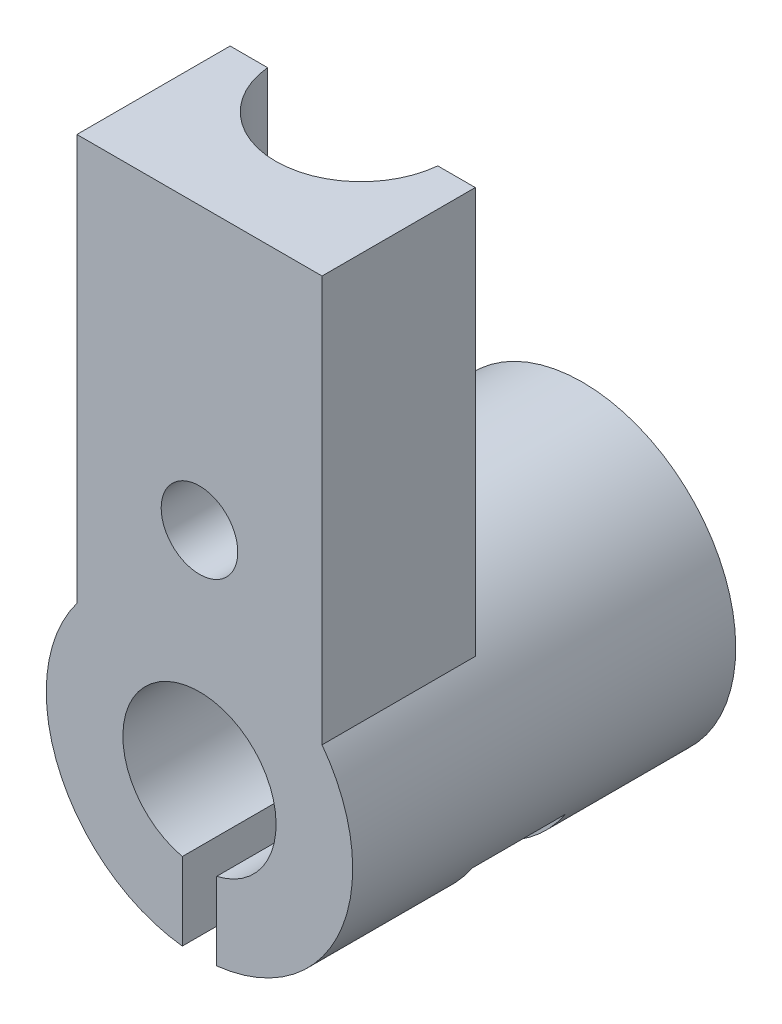
ISO-10303-21;
HEADER;
FILE_DESCRIPTION(('STEP AP214'),'2;1');
FILE_NAME('part.step','',(''),(''),'','','');
FILE_SCHEMA(('AUTOMOTIVE_DESIGN { 1 0 10303 214 1 1 1 1 }'));
ENDSEC;
DATA;
#1=APPLICATION_CONTEXT('core data for automotive mechanical design processes');
#2=APPLICATION_PROTOCOL_DEFINITION('international standard','automotive_design',2000,#1);
#3=PRODUCT_CONTEXT('',#1,'mechanical');
#4=PRODUCT('Part','Part','',(#3));
#5=PRODUCT_RELATED_PRODUCT_CATEGORY('part','',(#4));
#6=PRODUCT_DEFINITION_FORMATION('','',#4);
#7=PRODUCT_DEFINITION_CONTEXT('part definition',#1,'design');
#8=PRODUCT_DEFINITION('design','',#6,#7);
#9=PRODUCT_DEFINITION_SHAPE('','',#8);
#10=(LENGTH_UNIT() NAMED_UNIT(*) SI_UNIT(.MILLI.,.METRE.));
#11=(NAMED_UNIT(*) PLANE_ANGLE_UNIT() SI_UNIT($,.RADIAN.));
#12=(NAMED_UNIT(*) SI_UNIT($,.STERADIAN.) SOLID_ANGLE_UNIT());
#13=UNCERTAINTY_MEASURE_WITH_UNIT(LENGTH_MEASURE(1.E-05),#10,'distance_accuracy_value','');
#14=(GEOMETRIC_REPRESENTATION_CONTEXT(3) GLOBAL_UNCERTAINTY_ASSIGNED_CONTEXT((#13)) GLOBAL_UNIT_ASSIGNED_CONTEXT((#10,
#11,#12)) REPRESENTATION_CONTEXT('',''));
#15=CARTESIAN_POINT('',(0.,0.,0.));
#16=DIRECTION('',(0.,0.,1.));
#17=DIRECTION('',(1.,0.,0.));
#18=AXIS2_PLACEMENT_3D('',#15,#16,#17);
#19=CARTESIAN_POINT('',(0.,0.,50.));
#20=DIRECTION('',(0.,0.,-1.));
#21=DIRECTION('',(-1.,0.,0.));
#22=AXIS2_PLACEMENT_3D('',#19,#20,#21);
#23=CYLINDRICAL_SURFACE('',#22,20.);
#24=CARTESIAN_POINT('',(0.,0.,18.875997862175));
#25=DIRECTION('',(0.,0.,-1.));
#26=DIRECTION('',(0.,1.,0.));
#27=AXIS2_PLACEMENT_3D('',#24,#25,#26);
#28=CIRCLE('',#27,20.);
#29=CARTESIAN_POINT('',(-7.41781842502269,-18.5735287388637,18.8759978621752));
#30=VERTEX_POINT('',#29);
#31=CARTESIAN_POINT('',(-16.6546378306333,-11.0735287388637,18.8759978621751));
#32=VERTEX_POINT('',#31);
#33=EDGE_CURVE('E302',#30,#32,#28,.T.);
#34=ORIENTED_EDGE('',*,*,#33,.T.);
#35=DIRECTION('',(0.,0.,-1.));
#36=VECTOR('',#35,1.);
#37=CARTESIAN_POINT('',(-16.6546378306333,-11.0735287388637,50.));
#38=LINE('',#37,#36);
#39=CARTESIAN_POINT('',(-16.6546378306333,-11.0735287388637,31.1240021378249));
#40=VERTEX_POINT('',#39);
#41=EDGE_CURVE('E11',#32,#40,#38,.F.);
#42=ORIENTED_EDGE('',*,*,#41,.T.);
#43=CARTESIAN_POINT('',(0.,0.,31.1240021378249));
#44=DIRECTION('',(0.,0.,-1.));
#45=DIRECTION('',(-1.,0.,0.));
#46=AXIS2_PLACEMENT_3D('',#43,#44,#45);
#47=CIRCLE('',#46,20.);
#48=CARTESIAN_POINT('',(-7.41781842502269,-18.5735287388637,31.1240021378249));
#49=VERTEX_POINT('',#48);
#50=EDGE_CURVE('E41',#49,#40,#47,.T.);
#51=ORIENTED_EDGE('',*,*,#50,.F.);
#52=DIRECTION('',(0.,0.,-1.));
#53=VECTOR('',#52,1.);
#54=CARTESIAN_POINT('',(-7.41781842502269,-18.5735287388637,50.));
#55=LINE('',#54,#53);
#56=EDGE_CURVE('E304',#30,#49,#55,.F.);
#57=ORIENTED_EDGE('',*,*,#56,.F.);
#58=EDGE_LOOP('',(#34,#42,#51,#57));
#59=FACE_BOUND('',#58,.T.);
#60=CARTESIAN_POINT('',(0.,0.,0.));
#61=DIRECTION('',(0.,0.,1.));
#62=DIRECTION('',(1.,0.,0.));
#63=AXIS2_PLACEMENT_3D('',#60,#61,#62);
#64=CIRCLE('',#63,20.);
#65=CARTESIAN_POINT('',(2.24093647791154,-19.8740585614002,0.));
#66=VERTEX_POINT('',#65);
#67=CARTESIAN_POINT('',(-2.24093647791154,-19.8740585614002,0.));
#68=VERTEX_POINT('',#67);
#69=EDGE_CURVE('E271',#66,#68,#64,.T.);
#70=ORIENTED_EDGE('',*,*,#69,.T.);
#71=DIRECTION('',(0.,0.,-1.));
#72=VECTOR('',#71,1.);
#73=CARTESIAN_POINT('',(-2.24093647791154,-19.8740585614002,50.));
#74=LINE('',#73,#72);
#75=CARTESIAN_POINT('',(-2.24093647791154,-19.8740585614002,50.));
#76=VERTEX_POINT('',#75);
#77=EDGE_CURVE('E231',#68,#76,#74,.F.);
#78=ORIENTED_EDGE('',*,*,#77,.T.);
#79=CARTESIAN_POINT('',(0.,0.,50.));
#80=DIRECTION('',(0.,0.,1.));
#81=DIRECTION('',(1.,0.,0.));
#82=AXIS2_PLACEMENT_3D('',#79,#80,#81);
#83=CIRCLE('',#82,20.);
#84=CARTESIAN_POINT('',(-16.,12.,50.));
#85=VERTEX_POINT('',#84);
#86=EDGE_CURVE('E274',#85,#76,#83,.T.);
#87=ORIENTED_EDGE('',*,*,#86,.F.);
#88=DIRECTION('',(0.,0.,-1.));
#89=VECTOR('',#88,1.);
#90=CARTESIAN_POINT('',(-16.,12.,50.));
#91=LINE('',#90,#89);
#92=CARTESIAN_POINT('',(-16.,12.,30.));
#93=VERTEX_POINT('',#92);
#94=EDGE_CURVE('E252',#93,#85,#91,.F.);
#95=ORIENTED_EDGE('',*,*,#94,.F.);
#96=CARTESIAN_POINT('',(0.,0.,30.));
#97=DIRECTION('',(0.,0.,-1.));
#98=DIRECTION('',(-1.,0.,0.));
#99=AXIS2_PLACEMENT_3D('',#96,#97,#98);
#100=CIRCLE('',#99,20.);
#101=CARTESIAN_POINT('',(16.,12.,30.));
#102=VERTEX_POINT('',#101);
#103=EDGE_CURVE('E264',#102,#93,#100,.F.);
#104=ORIENTED_EDGE('',*,*,#103,.F.);
#105=DIRECTION('',(0.,0.,-1.));
#106=VECTOR('',#105,1.);
#107=CARTESIAN_POINT('',(16.,12.,50.));
#108=LINE('',#107,#106);
#109=CARTESIAN_POINT('',(16.,12.,50.));
#110=VERTEX_POINT('',#109);
#111=EDGE_CURVE('E256',#110,#102,#108,.T.);
#112=ORIENTED_EDGE('',*,*,#111,.F.);
#113=CARTESIAN_POINT('',(2.24093647791154,-19.8740585614002,50.));
#114=VERTEX_POINT('',#113);
#115=EDGE_CURVE('E278',#114,#110,#83,.T.);
#116=ORIENTED_EDGE('',*,*,#115,.F.);
#117=DIRECTION('',(0.,0.,-1.));
#118=VECTOR('',#117,1.);
#119=CARTESIAN_POINT('',(2.24093647791154,-19.8740585614002,50.));
#120=LINE('',#119,#118);
#121=EDGE_CURVE('E226',#114,#66,#120,.T.);
#122=ORIENTED_EDGE('',*,*,#121,.T.);
#123=EDGE_LOOP('',(#70,#78,#87,#95,#104,#112,#116,#122));
#124=FACE_BOUND('',#123,.T.);
#125=DIRECTION('',(0.,0.,-1.));
#126=VECTOR('',#125,1.);
#127=CARTESIAN_POINT('',(16.6546378306333,-11.0735287388637,50.));
#128=LINE('',#127,#126);
#129=CARTESIAN_POINT('',(16.6546378306333,-11.0735287388637,18.8759978621751));
#130=VERTEX_POINT('',#129);
#131=CARTESIAN_POINT('',(16.6546378306333,-11.0735287388637,31.1240021378249));
#132=VERTEX_POINT('',#131);
#133=EDGE_CURVE('E300',#130,#132,#128,.F.);
#134=ORIENTED_EDGE('',*,*,#133,.F.);
#135=CARTESIAN_POINT('',(0.,0.,18.875997862175));
#136=DIRECTION('',(0.,0.,1.));
#137=DIRECTION('',(0.,-1.,0.));
#138=AXIS2_PLACEMENT_3D('',#135,#136,#137);
#139=CIRCLE('',#138,20.);
#140=CARTESIAN_POINT('',(7.41781842502269,-18.5735287388637,18.8759978621752));
#141=VERTEX_POINT('',#140);
#142=EDGE_CURVE('E298',#141,#130,#139,.T.);
#143=ORIENTED_EDGE('',*,*,#142,.F.);
#144=DIRECTION('',(0.,0.,-1.));
#145=VECTOR('',#144,1.);
#146=CARTESIAN_POINT('',(7.41781842502269,-18.5735287388637,50.));
#147=LINE('',#146,#145);
#148=CARTESIAN_POINT('',(7.41781842502269,-18.5735287388637,31.1240021378249));
#149=VERTEX_POINT('',#148);
#150=EDGE_CURVE('E295',#141,#149,#147,.F.);
#151=ORIENTED_EDGE('',*,*,#150,.T.);
#152=CARTESIAN_POINT('',(0.,0.,31.1240021378249));
#153=DIRECTION('',(0.,0.,1.));
#154=DIRECTION('',(1.,0.,0.));
#155=AXIS2_PLACEMENT_3D('',#152,#153,#154);
#156=CIRCLE('',#155,20.);
#157=EDGE_CURVE('E292',#149,#132,#156,.T.);
#158=ORIENTED_EDGE('',*,*,#157,.T.);
#159=EDGE_LOOP('',(#134,#143,#151,#158));
#160=FACE_BOUND('',#159,.T.);
#161=ADVANCED_FACE('F33',(#59,#124,#160),#23,.T.);
#162=CARTESIAN_POINT('',(0.,0.,50.));
#163=DIRECTION('',(0.,0.,1.));
#164=DIRECTION('',(1.,0.,0.));
#165=AXIS2_PLACEMENT_3D('',#162,#163,#164);
#166=PLANE('',#165);
#167=CARTESIAN_POINT('',(0.,28.2747803986461,50.));
#168=DIRECTION('',(0.,0.,-1.));
#169=DIRECTION('',(-1.,0.,0.));
#170=AXIS2_PLACEMENT_3D('',#167,#168,#169);
#171=CIRCLE('',#170,5.);
#172=CARTESIAN_POINT('',(-5.00000000000001,28.2747803986461,50.));
#173=VERTEX_POINT('',#172);
#174=EDGE_CURVE('E213',#173,#173,#171,.T.);
#175=ORIENTED_EDGE('',*,*,#174,.T.);
#176=EDGE_LOOP('',(#175));
#177=FACE_BOUND('',#176,.T.);
#178=DIRECTION('',(0.,1.,0.));
#179=VECTOR('',#178,1.);
#180=CARTESIAN_POINT('',(-2.24093647791154,-24.2648059732591,50.));
#181=LINE('',#180,#179);
#182=CARTESIAN_POINT('',(-2.24093647791154,-9.74567615417039,50.));
#183=VERTEX_POINT('',#182);
#184=EDGE_CURVE('E219',#76,#183,#181,.T.);
#185=ORIENTED_EDGE('',*,*,#184,.T.);
#186=CARTESIAN_POINT('',(0.,0.,50.));
#187=DIRECTION('',(0.,0.,1.));
#188=DIRECTION('',(1.,0.,0.));
#189=AXIS2_PLACEMENT_3D('',#186,#187,#188);
#190=CIRCLE('',#189,10.);
#191=CARTESIAN_POINT('',(2.24093647791154,-9.74567615417039,50.));
#192=VERTEX_POINT('',#191);
#193=EDGE_CURVE('E268',#192,#183,#190,.T.);
#194=ORIENTED_EDGE('',*,*,#193,.F.);
#195=DIRECTION('',(0.,-1.,0.));
#196=VECTOR('',#195,1.);
#197=CARTESIAN_POINT('',(2.24093647791154,-24.2648059732591,50.));
#198=LINE('',#197,#196);
#199=EDGE_CURVE('E222',#192,#114,#198,.T.);
#200=ORIENTED_EDGE('',*,*,#199,.T.);
#201=ORIENTED_EDGE('',*,*,#115,.T.);
#202=DIRECTION('',(0.,1.,0.));
#203=VECTOR('',#202,1.);
#204=CARTESIAN_POINT('',(16.,-20.001,50.));
#205=LINE('',#204,#203);
#206=CARTESIAN_POINT('',(16.,65.,50.));
#207=VERTEX_POINT('',#206);
#208=EDGE_CURVE('E242',#110,#207,#205,.T.);
#209=ORIENTED_EDGE('',*,*,#208,.T.);
#210=DIRECTION('',(1.,0.,0.));
#211=VECTOR('',#210,1.);
#212=CARTESIAN_POINT('',(-16.,65.,50.));
#213=LINE('',#212,#211);
#214=CARTESIAN_POINT('',(-16.,65.,50.));
#215=VERTEX_POINT('',#214);
#216=EDGE_CURVE('E247',#215,#207,#213,.T.);
#217=ORIENTED_EDGE('',*,*,#216,.F.);
#218=DIRECTION('',(0.,1.,0.));
#219=VECTOR('',#218,1.);
#220=CARTESIAN_POINT('',(-16.,-20.001,50.));
#221=LINE('',#220,#219);
#222=EDGE_CURVE('E254',#85,#215,#221,.T.);
#223=ORIENTED_EDGE('',*,*,#222,.F.);
#224=ORIENTED_EDGE('',*,*,#86,.T.);
#225=EDGE_LOOP('',(#185,#194,#200,#201,#209,#217,#223,#224));
#226=FACE_BOUND('',#225,.T.);
#227=ADVANCED_FACE('F324',(#177,#226),#166,.T.);
#228=CARTESIAN_POINT('',(0.,0.,0.));
#229=DIRECTION('',(0.,0.,1.));
#230=DIRECTION('',(1.,0.,0.));
#231=AXIS2_PLACEMENT_3D('',#228,#229,#230);
#232=PLANE('',#231);
#233=CARTESIAN_POINT('',(0.,0.,0.));
#234=DIRECTION('',(0.,0.,1.));
#235=DIRECTION('',(1.,0.,0.));
#236=AXIS2_PLACEMENT_3D('',#233,#234,#235);
#237=CIRCLE('',#236,10.);
#238=CARTESIAN_POINT('',(2.24093647791154,-9.74567615417039,0.));
#239=VERTEX_POINT('',#238);
#240=CARTESIAN_POINT('',(-2.24093647791154,-9.74567615417039,0.));
#241=VERTEX_POINT('',#240);
#242=EDGE_CURVE('E261',#239,#241,#237,.T.);
#243=ORIENTED_EDGE('',*,*,#242,.T.);
#244=DIRECTION('',(0.,1.,0.));
#245=VECTOR('',#244,1.);
#246=CARTESIAN_POINT('',(-2.24093647791154,-24.2648059732591,0.));
#247=LINE('',#246,#245);
#248=EDGE_CURVE('E216',#68,#241,#247,.T.);
#249=ORIENTED_EDGE('',*,*,#248,.F.);
#250=ORIENTED_EDGE('',*,*,#69,.F.);
#251=DIRECTION('',(0.,-1.,0.));
#252=VECTOR('',#251,1.);
#253=CARTESIAN_POINT('',(2.24093647791154,-24.2648059732591,0.));
#254=LINE('',#253,#252);
#255=EDGE_CURVE('E223',#239,#66,#254,.T.);
#256=ORIENTED_EDGE('',*,*,#255,.F.);
#257=EDGE_LOOP('',(#243,#249,#250,#256));
#258=FACE_BOUND('',#257,.T.);
#259=ADVANCED_FACE('F330',(#258),#232,.F.);
#260=CARTESIAN_POINT('',(0.,0.,50.));
#261=DIRECTION('',(0.,0.,-1.));
#262=DIRECTION('',(-1.,0.,0.));
#263=AXIS2_PLACEMENT_3D('',#260,#261,#262);
#264=CYLINDRICAL_SURFACE('',#263,10.);
#265=DIRECTION('',(0.,0.,-1.));
#266=VECTOR('',#265,1.);
#267=CARTESIAN_POINT('',(-2.24093647791154,-9.74567615417039,50.));
#268=LINE('',#267,#266);
#269=EDGE_CURVE('E290',#241,#183,#268,.F.);
#270=ORIENTED_EDGE('',*,*,#269,.F.);
#271=ORIENTED_EDGE('',*,*,#242,.F.);
#272=DIRECTION('',(0.,0.,-1.));
#273=VECTOR('',#272,1.);
#274=CARTESIAN_POINT('',(2.24093647791154,-9.74567615417039,50.));
#275=LINE('',#274,#273);
#276=EDGE_CURVE('E288',#192,#239,#275,.T.);
#277=ORIENTED_EDGE('',*,*,#276,.F.);
#278=ORIENTED_EDGE('',*,*,#193,.T.);
#279=EDGE_LOOP('',(#270,#271,#277,#278));
#280=FACE_BOUND('',#279,.T.);
#281=ADVANCED_FACE('F338',(#280),#264,.F.);
#282=CARTESIAN_POINT('',(0.,65.,0.));
#283=DIRECTION('',(0.,1.,0.));
#284=DIRECTION('',(0.,0.,1.));
#285=AXIS2_PLACEMENT_3D('',#282,#283,#284);
#286=PLANE('',#285);
#287=CARTESIAN_POINT('',(0.,65.,28.900111212638));
#288=DIRECTION('',(0.,1.,0.));
#289=DIRECTION('',(0.,0.,1.));
#290=AXIS2_PLACEMENT_3D('',#287,#288,#289);
#291=CIRCLE('',#290,11.1615123641754);
#292=CARTESIAN_POINT('',(-11.1071869936126,65.,30.));
#293=VERTEX_POINT('',#292);
#294=CARTESIAN_POINT('',(11.1071869936126,65.,30.));
#295=VERTEX_POINT('',#294);
#296=EDGE_CURVE('E234',#293,#295,#291,.T.);
#297=ORIENTED_EDGE('',*,*,#296,.F.);
#298=DIRECTION('',(-1.,0.,0.));
#299=VECTOR('',#298,1.);
#300=CARTESIAN_POINT('',(-16.,65.,30.));
#301=LINE('',#300,#299);
#302=CARTESIAN_POINT('',(-16.,65.,30.));
#303=VERTEX_POINT('',#302);
#304=EDGE_CURVE('E243',#293,#303,#301,.T.);
#305=ORIENTED_EDGE('',*,*,#304,.T.);
#306=DIRECTION('',(0.,0.,1.));
#307=VECTOR('',#306,1.);
#308=CARTESIAN_POINT('',(-16.,65.,30.));
#309=LINE('',#308,#307);
#310=EDGE_CURVE('E237',#303,#215,#309,.T.);
#311=ORIENTED_EDGE('',*,*,#310,.T.);
#312=ORIENTED_EDGE('',*,*,#216,.T.);
#313=DIRECTION('',(0.,0.,-1.));
#314=VECTOR('',#313,1.);
#315=CARTESIAN_POINT('',(16.,65.,30.));
#316=LINE('',#315,#314);
#317=CARTESIAN_POINT('',(16.,65.,30.));
#318=VERTEX_POINT('',#317);
#319=EDGE_CURVE('E244',#207,#318,#316,.T.);
#320=ORIENTED_EDGE('',*,*,#319,.T.);
#321=EDGE_CURVE('E239',#318,#295,#301,.T.);
#322=ORIENTED_EDGE('',*,*,#321,.T.);
#323=EDGE_LOOP('',(#297,#305,#311,#312,#320,#322));
#324=FACE_BOUND('',#323,.T.);
#325=ADVANCED_FACE('F344',(#324),#286,.T.);
#326=CARTESIAN_POINT('',(16.,-20.001,30.));
#327=DIRECTION('',(1.,0.,0.));
#328=DIRECTION('',(0.,0.,-1.));
#329=AXIS2_PLACEMENT_3D('',#326,#327,#328);
#330=PLANE('',#329);
#331=ORIENTED_EDGE('',*,*,#208,.F.);
#332=ORIENTED_EDGE('',*,*,#111,.T.);
#333=DIRECTION('',(0.,1.,0.));
#334=VECTOR('',#333,1.);
#335=CARTESIAN_POINT('',(16.,-20.001,30.));
#336=LINE('',#335,#334);
#337=EDGE_CURVE('E259',#102,#318,#336,.T.);
#338=ORIENTED_EDGE('',*,*,#337,.T.);
#339=ORIENTED_EDGE('',*,*,#319,.F.);
#340=EDGE_LOOP('',(#331,#332,#338,#339));
#341=FACE_BOUND('',#340,.T.);
#342=ADVANCED_FACE('F349',(#341),#330,.T.);
#343=CARTESIAN_POINT('',(-16.,-20.001,30.));
#344=DIRECTION('',(0.,0.,-1.));
#345=DIRECTION('',(-1.,0.,0.));
#346=AXIS2_PLACEMENT_3D('',#343,#344,#345);
#347=PLANE('',#346);
#348=CARTESIAN_POINT('',(0.,28.2747803986461,30.));
#349=DIRECTION('',(0.,0.,-1.));
#350=DIRECTION('',(-1.,0.,0.));
#351=AXIS2_PLACEMENT_3D('',#348,#349,#350);
#352=CIRCLE('',#351,5.);
#353=CARTESIAN_POINT('',(-5.,28.2747803986461,30.));
#354=VERTEX_POINT('',#353);
#355=EDGE_CURVE('E205',#354,#354,#352,.T.);
#356=ORIENTED_EDGE('',*,*,#355,.F.);
#357=EDGE_LOOP('',(#356));
#358=FACE_BOUND('',#357,.T.);
#359=DIRECTION('',(0.,1.,0.));
#360=VECTOR('',#359,1.);
#361=CARTESIAN_POINT('',(-11.1071869936126,40.,30.));
#362=LINE('',#361,#360);
#363=CARTESIAN_POINT('',(-11.1071869936126,40.,30.));
#364=VERTEX_POINT('',#363);
#365=EDGE_CURVE('E286',#364,#293,#362,.T.);
#366=ORIENTED_EDGE('',*,*,#365,.F.);
#367=DIRECTION('',(1.,0.,0.));
#368=VECTOR('',#367,1.);
#369=CARTESIAN_POINT('',(-16.,40.,30.));
#370=LINE('',#369,#368);
#371=CARTESIAN_POINT('',(11.1071869936126,40.,30.));
#372=VERTEX_POINT('',#371);
#373=EDGE_CURVE('E277',#364,#372,#370,.T.);
#374=ORIENTED_EDGE('',*,*,#373,.T.);
#375=DIRECTION('',(0.,1.,0.));
#376=VECTOR('',#375,1.);
#377=CARTESIAN_POINT('',(11.1071869936126,40.,30.));
#378=LINE('',#377,#376);
#379=EDGE_CURVE('E283',#295,#372,#378,.F.);
#380=ORIENTED_EDGE('',*,*,#379,.F.);
#381=ORIENTED_EDGE('',*,*,#321,.F.);
#382=ORIENTED_EDGE('',*,*,#337,.F.);
#383=ORIENTED_EDGE('',*,*,#103,.T.);
#384=DIRECTION('',(0.,1.,0.));
#385=VECTOR('',#384,1.);
#386=CARTESIAN_POINT('',(-16.,-20.001,30.));
#387=LINE('',#386,#385);
#388=EDGE_CURVE('E255',#93,#303,#387,.T.);
#389=ORIENTED_EDGE('',*,*,#388,.T.);
#390=ORIENTED_EDGE('',*,*,#304,.F.);
#391=EDGE_LOOP('',(#366,#374,#380,#381,#382,#383,#389,#390));
#392=FACE_BOUND('',#391,.T.);
#393=ADVANCED_FACE('F346',(#358,#392),#347,.T.);
#394=CARTESIAN_POINT('',(-16.,-20.001,30.));
#395=DIRECTION('',(-1.,0.,0.));
#396=DIRECTION('',(0.,0.,1.));
#397=AXIS2_PLACEMENT_3D('',#394,#395,#396);
#398=PLANE('',#397);
#399=ORIENTED_EDGE('',*,*,#388,.F.);
#400=ORIENTED_EDGE('',*,*,#94,.T.);
#401=ORIENTED_EDGE('',*,*,#222,.T.);
#402=ORIENTED_EDGE('',*,*,#310,.F.);
#403=EDGE_LOOP('',(#399,#400,#401,#402));
#404=FACE_BOUND('',#403,.T.);
#405=ADVANCED_FACE('F348',(#404),#398,.T.);
#406=CARTESIAN_POINT('',(0.,40.,28.900111212638));
#407=DIRECTION('',(0.,1.,0.));
#408=DIRECTION('',(0.,0.,1.));
#409=AXIS2_PLACEMENT_3D('',#406,#407,#408);
#410=CYLINDRICAL_SURFACE('',#409,11.1615123641754);
#411=ORIENTED_EDGE('',*,*,#365,.T.);
#412=ORIENTED_EDGE('',*,*,#296,.T.);
#413=ORIENTED_EDGE('',*,*,#379,.T.);
#414=CARTESIAN_POINT('',(0.,40.,28.900111212638));
#415=DIRECTION('',(0.,1.,0.));
#416=DIRECTION('',(0.,0.,1.));
#417=AXIS2_PLACEMENT_3D('',#414,#415,#416);
#418=CIRCLE('',#417,11.1615123641754);
#419=EDGE_CURVE('E235',#364,#372,#418,.T.);
#420=ORIENTED_EDGE('',*,*,#419,.F.);
#421=EDGE_LOOP('',(#411,#412,#413,#420));
#422=FACE_BOUND('',#421,.T.);
#423=ADVANCED_FACE('F356',(#422),#410,.F.);
#424=CARTESIAN_POINT('',(0.,40.,28.900111212638));
#425=DIRECTION('',(0.,1.,0.));
#426=DIRECTION('',(0.,0.,1.));
#427=AXIS2_PLACEMENT_3D('',#424,#425,#426);
#428=PLANE('',#427);
#429=ORIENTED_EDGE('',*,*,#419,.T.);
#430=ORIENTED_EDGE('',*,*,#373,.F.);
#431=EDGE_LOOP('',(#429,#430));
#432=FACE_BOUND('',#431,.T.);
#433=ADVANCED_FACE('F363',(#432),#428,.T.);
#434=CARTESIAN_POINT('',(2.24093647791154,-24.2648059732591,50.));
#435=DIRECTION('',(1.,0.,0.));
#436=DIRECTION('',(0.,0.,-1.));
#437=AXIS2_PLACEMENT_3D('',#434,#435,#436);
#438=PLANE('',#437);
#439=CARTESIAN_POINT('',(2.24093647791154,-14.8235287388636,25.));
#440=DIRECTION('',(1.,0.,0.));
#441=DIRECTION('',(0.,0.,-1.));
#442=AXIS2_PLACEMENT_3D('',#439,#440,#441);
#443=CIRCLE('',#442,3.);
#444=CARTESIAN_POINT('',(2.24093647791154,-14.8235287388636,22.));
#445=VERTEX_POINT('',#444);
#446=EDGE_CURVE('E176',#445,#445,#443,.T.);
#447=ORIENTED_EDGE('',*,*,#446,.T.);
#448=EDGE_LOOP('',(#447));
#449=FACE_BOUND('',#448,.T.);
#450=ORIENTED_EDGE('',*,*,#199,.F.);
#451=ORIENTED_EDGE('',*,*,#276,.T.);
#452=ORIENTED_EDGE('',*,*,#255,.T.);
#453=ORIENTED_EDGE('',*,*,#121,.F.);
#454=EDGE_LOOP('',(#450,#451,#452,#453));
#455=FACE_BOUND('',#454,.T.);
#456=ADVANCED_FACE('F367',(#449,#455),#438,.F.);
#457=CARTESIAN_POINT('',(-2.24093647791154,-24.2648059732591,50.));
#458=DIRECTION('',(-1.,0.,0.));
#459=DIRECTION('',(0.,0.,1.));
#460=AXIS2_PLACEMENT_3D('',#457,#458,#459);
#461=PLANE('',#460);
#462=CARTESIAN_POINT('',(-2.24093647791154,-14.8235287388636,25.));
#463=DIRECTION('',(-1.,0.,0.));
#464=DIRECTION('',(0.,0.,1.));
#465=AXIS2_PLACEMENT_3D('',#462,#463,#464);
#466=CIRCLE('',#465,3.);
#467=CARTESIAN_POINT('',(-2.24093647791154,-14.8235287388636,28.));
#468=VERTEX_POINT('',#467);
#469=EDGE_CURVE('E179',#468,#468,#466,.T.);
#470=ORIENTED_EDGE('',*,*,#469,.T.);
#471=EDGE_LOOP('',(#470));
#472=FACE_BOUND('',#471,.T.);
#473=ORIENTED_EDGE('',*,*,#248,.T.);
#474=ORIENTED_EDGE('',*,*,#269,.T.);
#475=ORIENTED_EDGE('',*,*,#184,.F.);
#476=ORIENTED_EDGE('',*,*,#77,.F.);
#477=EDGE_LOOP('',(#473,#474,#475,#476));
#478=FACE_BOUND('',#477,.T.);
#479=ADVANCED_FACE('F369',(#472,#478),#461,.F.);
#480=CARTESIAN_POINT('',(0.,28.2747803986461,50.));
#481=DIRECTION('',(0.,0.,-1.));
#482=DIRECTION('',(-1.,0.,0.));
#483=AXIS2_PLACEMENT_3D('',#480,#481,#482);
#484=CYLINDRICAL_SURFACE('',#483,5.);
#485=ORIENTED_EDGE('',*,*,#174,.F.);
#486=EDGE_LOOP('',(#485));
#487=FACE_BOUND('',#486,.T.);
#488=ORIENTED_EDGE('',*,*,#355,.T.);
#489=EDGE_LOOP('',(#488));
#490=FACE_BOUND('',#489,.T.);
#491=ADVANCED_FACE('F372',(#487,#490),#484,.F.);
#492=CARTESIAN_POINT('',(4.,-11.0735287388637,0.));
#493=DIRECTION('',(0.,-1.,0.));
#494=DIRECTION('',(0.,0.,-1.));
#495=AXIS2_PLACEMENT_3D('',#492,#493,#494);
#496=PLANE('',#495);
#497=ORIENTED_EDGE('',*,*,#133,.T.);
#498=DIRECTION('',(1.,0.,0.));
#499=VECTOR('',#498,1.);
#500=CARTESIAN_POINT('',(4.,-11.0735287388637,31.1240021378249));
#501=LINE('',#500,#499);
#502=CARTESIAN_POINT('',(4.,-11.0735287388637,31.1240021378249));
#503=VERTEX_POINT('',#502);
#504=EDGE_CURVE('E56',#503,#132,#501,.T.);
#505=ORIENTED_EDGE('',*,*,#504,.F.);
#506=DIRECTION('',(0.,0.,-1.));
#507=VECTOR('',#506,1.);
#508=CARTESIAN_POINT('',(4.,-11.0735287388637,0.));
#509=LINE('',#508,#507);
#510=CARTESIAN_POINT('',(4.,-11.0735287388637,18.8759978621751));
#511=VERTEX_POINT('',#510);
#512=EDGE_CURVE('E187',#503,#511,#509,.T.);
#513=ORIENTED_EDGE('',*,*,#512,.T.);
#514=DIRECTION('',(1.,0.,0.));
#515=VECTOR('',#514,1.);
#516=CARTESIAN_POINT('',(4.,-11.0735287388637,18.8759978621751));
#517=LINE('',#516,#515);
#518=EDGE_CURVE('E202',#511,#130,#517,.T.);
#519=ORIENTED_EDGE('',*,*,#518,.T.);
#520=EDGE_LOOP('',(#497,#505,#513,#519));
#521=FACE_BOUND('',#520,.T.);
#522=ADVANCED_FACE('F379',(#521),#496,.T.);
#523=CARTESIAN_POINT('',(4.,1.39710449595746E-13,18.875997862175));
#524=DIRECTION('',(0.,0.,1.));
#525=DIRECTION('',(0.,-1.,0.));
#526=AXIS2_PLACEMENT_3D('',#523,#524,#525);
#527=PLANE('',#526);
#528=ORIENTED_EDGE('',*,*,#142,.T.);
#529=ORIENTED_EDGE('',*,*,#518,.F.);
#530=DIRECTION('',(0.,-1.,0.));
#531=VECTOR('',#530,1.);
#532=CARTESIAN_POINT('',(4.,1.39710449595746E-13,18.875997862175));
#533=LINE('',#532,#531);
#534=CARTESIAN_POINT('',(4.,-18.5735287388637,18.8759978621752));
#535=VERTEX_POINT('',#534);
#536=EDGE_CURVE('E200',#511,#535,#533,.T.);
#537=ORIENTED_EDGE('',*,*,#536,.T.);
#538=DIRECTION('',(1.,0.,0.));
#539=VECTOR('',#538,1.);
#540=CARTESIAN_POINT('',(4.,-18.5735287388637,18.8759978621752));
#541=LINE('',#540,#539);
#542=EDGE_CURVE('E206',#535,#141,#541,.T.);
#543=ORIENTED_EDGE('',*,*,#542,.T.);
#544=EDGE_LOOP('',(#528,#529,#537,#543));
#545=FACE_BOUND('',#544,.T.);
#546=ADVANCED_FACE('F383',(#545),#527,.T.);
#547=CARTESIAN_POINT('',(4.,-18.5735287388637,0.));
#548=DIRECTION('',(0.,-1.,0.));
#549=DIRECTION('',(0.,0.,-1.));
#550=AXIS2_PLACEMENT_3D('',#547,#548,#549);
#551=PLANE('',#550);
#552=ORIENTED_EDGE('',*,*,#542,.F.);
#553=DIRECTION('',(0.,0.,-1.));
#554=VECTOR('',#553,1.);
#555=CARTESIAN_POINT('',(4.,-18.5735287388637,0.));
#556=LINE('',#555,#554);
#557=CARTESIAN_POINT('',(4.,-18.5735287388637,31.1240021378249));
#558=VERTEX_POINT('',#557);
#559=EDGE_CURVE('E197',#558,#535,#556,.T.);
#560=ORIENTED_EDGE('',*,*,#559,.F.);
#561=DIRECTION('',(1.,0.,0.));
#562=VECTOR('',#561,1.);
#563=CARTESIAN_POINT('',(4.,-18.5735287388637,31.1240021378249));
#564=LINE('',#563,#562);
#565=EDGE_CURVE('E209',#558,#149,#564,.T.);
#566=ORIENTED_EDGE('',*,*,#565,.T.);
#567=ORIENTED_EDGE('',*,*,#150,.F.);
#568=EDGE_LOOP('',(#552,#560,#566,#567));
#569=FACE_BOUND('',#568,.T.);
#570=ADVANCED_FACE('F389',(#569),#551,.F.);
#571=CARTESIAN_POINT('',(4.,0.,31.1240021378249));
#572=DIRECTION('',(0.,0.,1.));
#573=DIRECTION('',(1.,0.,0.));
#574=AXIS2_PLACEMENT_3D('',#571,#572,#573);
#575=PLANE('',#574);
#576=ORIENTED_EDGE('',*,*,#565,.F.);
#577=DIRECTION('',(0.,-1.,0.));
#578=VECTOR('',#577,1.);
#579=CARTESIAN_POINT('',(4.,0.,31.1240021378249));
#580=LINE('',#579,#578);
#581=EDGE_CURVE('E194',#503,#558,#580,.T.);
#582=ORIENTED_EDGE('',*,*,#581,.F.);
#583=ORIENTED_EDGE('',*,*,#504,.T.);
#584=ORIENTED_EDGE('',*,*,#157,.F.);
#585=EDGE_LOOP('',(#576,#582,#583,#584));
#586=FACE_BOUND('',#585,.T.);
#587=ADVANCED_FACE('F385',(#586),#575,.F.);
#588=CARTESIAN_POINT('',(4.,0.,0.));
#589=DIRECTION('',(1.,0.,0.));
#590=DIRECTION('',(0.,0.,-1.));
#591=AXIS2_PLACEMENT_3D('',#588,#589,#590);
#592=PLANE('',#591);
#593=CARTESIAN_POINT('',(4.,-14.8235287388636,25.));
#594=DIRECTION('',(1.,0.,0.));
#595=DIRECTION('',(0.,0.,-1.));
#596=AXIS2_PLACEMENT_3D('',#593,#594,#595);
#597=CIRCLE('',#596,3.);
#598=CARTESIAN_POINT('',(4.,-14.8235287388636,22.));
#599=VERTEX_POINT('',#598);
#600=EDGE_CURVE('E36',#599,#599,#597,.T.);
#601=ORIENTED_EDGE('',*,*,#600,.F.);
#602=EDGE_LOOP('',(#601));
#603=FACE_BOUND('',#602,.T.);
#604=ORIENTED_EDGE('',*,*,#512,.F.);
#605=ORIENTED_EDGE('',*,*,#581,.T.);
#606=ORIENTED_EDGE('',*,*,#559,.T.);
#607=ORIENTED_EDGE('',*,*,#536,.F.);
#608=EDGE_LOOP('',(#604,#605,#606,#607));
#609=FACE_BOUND('',#608,.T.);
#610=ADVANCED_FACE('F388',(#603,#609),#592,.T.);
#611=CARTESIAN_POINT('',(-4.,-11.0735287388637,0.));
#612=DIRECTION('',(0.,1.,0.));
#613=DIRECTION('',(0.,0.,1.));
#614=AXIS2_PLACEMENT_3D('',#611,#612,#613);
#615=PLANE('',#614);
#616=DIRECTION('',(-1.,0.,0.));
#617=VECTOR('',#616,1.);
#618=CARTESIAN_POINT('',(-4.,-11.0735287388637,18.8759978621751));
#619=LINE('',#618,#617);
#620=CARTESIAN_POINT('',(-4.,-11.0735287388637,18.8759978621751));
#621=VERTEX_POINT('',#620);
#622=EDGE_CURVE('E48',#621,#32,#619,.T.);
#623=ORIENTED_EDGE('',*,*,#622,.F.);
#624=DIRECTION('',(0.,0.,-1.));
#625=VECTOR('',#624,1.);
#626=CARTESIAN_POINT('',(-4.,-11.0735287388637,0.));
#627=LINE('',#626,#625);
#628=CARTESIAN_POINT('',(-4.,-11.0735287388637,31.1240021378249));
#629=VERTEX_POINT('',#628);
#630=EDGE_CURVE('E160',#629,#621,#627,.T.);
#631=ORIENTED_EDGE('',*,*,#630,.F.);
#632=DIRECTION('',(-1.,0.,0.));
#633=VECTOR('',#632,1.);
#634=CARTESIAN_POINT('',(-4.,-11.0735287388637,31.1240021378249));
#635=LINE('',#634,#633);
#636=EDGE_CURVE('E185',#629,#40,#635,.T.);
#637=ORIENTED_EDGE('',*,*,#636,.T.);
#638=ORIENTED_EDGE('',*,*,#41,.F.);
#639=EDGE_LOOP('',(#623,#631,#637,#638));
#640=FACE_BOUND('',#639,.T.);
#641=ADVANCED_FACE('F157',(#640),#615,.F.);
#642=CARTESIAN_POINT('',(-4.,0.,31.1240021378249));
#643=DIRECTION('',(0.,0.,-1.));
#644=DIRECTION('',(-1.,0.,0.));
#645=AXIS2_PLACEMENT_3D('',#642,#643,#644);
#646=PLANE('',#645);
#647=ORIENTED_EDGE('',*,*,#50,.T.);
#648=ORIENTED_EDGE('',*,*,#636,.F.);
#649=DIRECTION('',(0.,-1.,0.));
#650=VECTOR('',#649,1.);
#651=CARTESIAN_POINT('',(-4.,0.,31.1240021378249));
#652=LINE('',#651,#650);
#653=CARTESIAN_POINT('',(-4.,-18.5735287388637,31.1240021378249));
#654=VERTEX_POINT('',#653);
#655=EDGE_CURVE('E163',#629,#654,#652,.T.);
#656=ORIENTED_EDGE('',*,*,#655,.T.);
#657=DIRECTION('',(-1.,0.,0.));
#658=VECTOR('',#657,1.);
#659=CARTESIAN_POINT('',(-4.,-18.5735287388637,31.1240021378249));
#660=LINE('',#659,#658);
#661=EDGE_CURVE('E188',#654,#49,#660,.T.);
#662=ORIENTED_EDGE('',*,*,#661,.T.);
#663=EDGE_LOOP('',(#647,#648,#656,#662));
#664=FACE_BOUND('',#663,.T.);
#665=ADVANCED_FACE('F308',(#664),#646,.T.);
#666=CARTESIAN_POINT('',(-4.,-18.5735287388637,0.));
#667=DIRECTION('',(0.,1.,0.));
#668=DIRECTION('',(0.,0.,1.));
#669=AXIS2_PLACEMENT_3D('',#666,#667,#668);
#670=PLANE('',#669);
#671=ORIENTED_EDGE('',*,*,#56,.T.);
#672=ORIENTED_EDGE('',*,*,#661,.F.);
#673=DIRECTION('',(0.,0.,-1.));
#674=VECTOR('',#673,1.);
#675=CARTESIAN_POINT('',(-4.,-18.5735287388637,0.));
#676=LINE('',#675,#674);
#677=CARTESIAN_POINT('',(-4.,-18.5735287388637,18.8759978621752));
#678=VERTEX_POINT('',#677);
#679=EDGE_CURVE('E172',#654,#678,#676,.T.);
#680=ORIENTED_EDGE('',*,*,#679,.T.);
#681=DIRECTION('',(-1.,0.,0.));
#682=VECTOR('',#681,1.);
#683=CARTESIAN_POINT('',(-4.,-18.5735287388637,18.8759978621752));
#684=LINE('',#683,#682);
#685=EDGE_CURVE('E162',#678,#30,#684,.T.);
#686=ORIENTED_EDGE('',*,*,#685,.T.);
#687=EDGE_LOOP('',(#671,#672,#680,#686));
#688=FACE_BOUND('',#687,.T.);
#689=ADVANCED_FACE('F314',(#688),#670,.T.);
#690=CARTESIAN_POINT('',(-4.,1.39710449595746E-13,18.875997862175));
#691=DIRECTION('',(0.,0.,-1.));
#692=DIRECTION('',(0.,1.,0.));
#693=AXIS2_PLACEMENT_3D('',#690,#691,#692);
#694=PLANE('',#693);
#695=ORIENTED_EDGE('',*,*,#685,.F.);
#696=DIRECTION('',(0.,-1.,0.));
#697=VECTOR('',#696,1.);
#698=CARTESIAN_POINT('',(-4.,1.39710449595746E-13,18.875997862175));
#699=LINE('',#698,#697);
#700=EDGE_CURVE('E167',#621,#678,#699,.T.);
#701=ORIENTED_EDGE('',*,*,#700,.F.);
#702=ORIENTED_EDGE('',*,*,#622,.T.);
#703=ORIENTED_EDGE('',*,*,#33,.F.);
#704=EDGE_LOOP('',(#695,#701,#702,#703));
#705=FACE_BOUND('',#704,.T.);
#706=ADVANCED_FACE('F168',(#705),#694,.F.);
#707=CARTESIAN_POINT('',(-4.,0.,0.));
#708=DIRECTION('',(-1.,0.,0.));
#709=DIRECTION('',(0.,0.,-1.));
#710=AXIS2_PLACEMENT_3D('',#707,#708,#709);
#711=PLANE('',#710);
#712=CARTESIAN_POINT('',(-4.,-14.8235287388636,25.));
#713=DIRECTION('',(-1.,0.,0.));
#714=DIRECTION('',(0.,0.,1.));
#715=AXIS2_PLACEMENT_3D('',#712,#713,#714);
#716=CIRCLE('',#715,3.);
#717=CARTESIAN_POINT('',(-4.,-14.8235287388636,28.));
#718=VERTEX_POINT('',#717);
#719=EDGE_CURVE('E467',#718,#718,#716,.T.);
#720=ORIENTED_EDGE('',*,*,#719,.F.);
#721=EDGE_LOOP('',(#720));
#722=FACE_BOUND('',#721,.T.);
#723=ORIENTED_EDGE('',*,*,#630,.T.);
#724=ORIENTED_EDGE('',*,*,#700,.T.);
#725=ORIENTED_EDGE('',*,*,#679,.F.);
#726=ORIENTED_EDGE('',*,*,#655,.F.);
#727=EDGE_LOOP('',(#723,#724,#725,#726));
#728=FACE_BOUND('',#727,.T.);
#729=ADVANCED_FACE('F175',(#722,#728),#711,.T.);
#730=CARTESIAN_POINT('',(20.,-14.8235287388636,25.));
#731=DIRECTION('',(-1.,0.,0.));
#732=DIRECTION('',(0.,0.,1.));
#733=AXIS2_PLACEMENT_3D('',#730,#731,#732);
#734=CYLINDRICAL_SURFACE('',#733,3.);
#735=ORIENTED_EDGE('',*,*,#600,.T.);
#736=EDGE_LOOP('',(#735));
#737=FACE_BOUND('',#736,.T.);
#738=ORIENTED_EDGE('',*,*,#446,.F.);
#739=EDGE_LOOP('',(#738));
#740=FACE_BOUND('',#739,.T.);
#741=ADVANCED_FACE('F441',(#737,#740),#734,.F.);
#742=ORIENTED_EDGE('',*,*,#719,.T.);
#743=EDGE_LOOP('',(#742));
#744=FACE_BOUND('',#743,.T.);
#745=ORIENTED_EDGE('',*,*,#469,.F.);
#746=EDGE_LOOP('',(#745));
#747=FACE_BOUND('',#746,.T.);
#748=ADVANCED_FACE('F451',(#744,#747),#734,.F.);
#749=CLOSED_SHELL('',(#161,#227,#259,#281,#325,#342,#393,#405,#423,#433,#456,#479,#491,#522,
#546,#570,#587,#610,#641,#665,#689,#706,#729,#741,#748));
#750=MANIFOLD_SOLID_BREP('B2',#749);
#751=ADVANCED_BREP_SHAPE_REPRESENTATION('',(#18,#750),#14);
#752=SHAPE_DEFINITION_REPRESENTATION(#9,#751);
ENDSEC;
END-ISO-10303-21;
